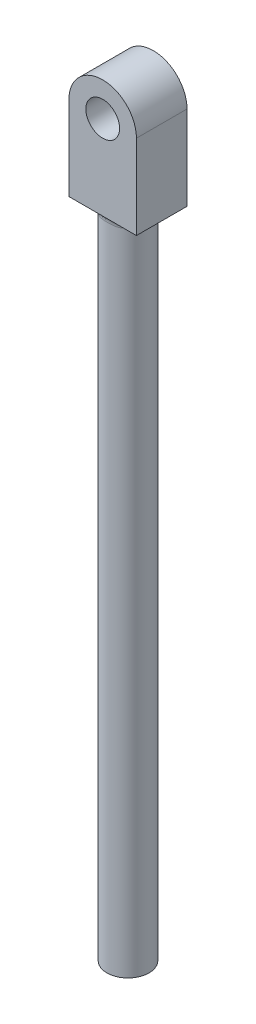
ISO-10303-21;
HEADER;
FILE_DESCRIPTION(('STEP AP214'),'2;1');
FILE_NAME('part.step','',(''),(''),'','','');
FILE_SCHEMA(('AUTOMOTIVE_DESIGN { 1 0 10303 214 1 1 1 1 }'));
ENDSEC;
DATA;
#1=APPLICATION_CONTEXT('core data for automotive mechanical design processes');
#2=APPLICATION_PROTOCOL_DEFINITION('international standard','automotive_design',2000,#1);
#3=PRODUCT_CONTEXT('',#1,'mechanical');
#4=PRODUCT('Part','Part','',(#3));
#5=PRODUCT_RELATED_PRODUCT_CATEGORY('part','',(#4));
#6=PRODUCT_DEFINITION_FORMATION('','',#4);
#7=PRODUCT_DEFINITION_CONTEXT('part definition',#1,'design');
#8=PRODUCT_DEFINITION('design','',#6,#7);
#9=PRODUCT_DEFINITION_SHAPE('','',#8);
#10=(LENGTH_UNIT() NAMED_UNIT(*) SI_UNIT(.MILLI.,.METRE.));
#11=(NAMED_UNIT(*) PLANE_ANGLE_UNIT() SI_UNIT($,.RADIAN.));
#12=(NAMED_UNIT(*) SI_UNIT($,.STERADIAN.) SOLID_ANGLE_UNIT());
#13=UNCERTAINTY_MEASURE_WITH_UNIT(LENGTH_MEASURE(1.E-05),#10,'distance_accuracy_value','');
#14=(GEOMETRIC_REPRESENTATION_CONTEXT(3) GLOBAL_UNCERTAINTY_ASSIGNED_CONTEXT((#13)) GLOBAL_UNIT_ASSIGNED_CONTEXT((#10,
#11,#12)) REPRESENTATION_CONTEXT('',''));
#15=CARTESIAN_POINT('',(0.,0.,0.));
#16=DIRECTION('',(0.,0.,1.));
#17=DIRECTION('',(1.,0.,0.));
#18=AXIS2_PLACEMENT_3D('',#15,#16,#17);
#19=CARTESIAN_POINT('',(4.,78.,3.));
#20=DIRECTION('',(0.,1.,0.));
#21=DIRECTION('',(0.,0.,1.));
#22=AXIS2_PLACEMENT_3D('',#19,#20,#21);
#23=PLANE('',#22);
#24=DIRECTION('',(1.,0.,0.));
#25=VECTOR('',#24,1.);
#26=CARTESIAN_POINT('',(4.,78.,3.));
#27=LINE('',#26,#25);
#28=CARTESIAN_POINT('',(1.802775637732,78.,3.));
#29=VERTEX_POINT('',#28);
#30=CARTESIAN_POINT('',(4.,78.,3.));
#31=VERTEX_POINT('',#30);
#32=EDGE_CURVE('E120',#29,#31,#27,.T.);
#33=ORIENTED_EDGE('',*,*,#32,.F.);
#34=CARTESIAN_POINT('',(0.,78.,0.));
#35=DIRECTION('',(0.,1.,0.));
#36=DIRECTION('',(0.,0.,1.));
#37=AXIS2_PLACEMENT_3D('',#34,#35,#36);
#38=CIRCLE('',#37,3.5);
#39=CARTESIAN_POINT('',(1.802775637732,78.,-3.));
#40=VERTEX_POINT('',#39);
#41=EDGE_CURVE('E139',#29,#40,#38,.T.);
#42=ORIENTED_EDGE('',*,*,#41,.T.);
#43=DIRECTION('',(1.,0.,0.));
#44=VECTOR('',#43,1.);
#45=CARTESIAN_POINT('',(4.,78.,-3.));
#46=LINE('',#45,#44);
#47=CARTESIAN_POINT('',(4.,78.,-3.));
#48=VERTEX_POINT('',#47);
#49=EDGE_CURVE('E244',#40,#48,#46,.T.);
#50=ORIENTED_EDGE('',*,*,#49,.T.);
#51=DIRECTION('',(0.,0.,-1.));
#52=VECTOR('',#51,1.);
#53=CARTESIAN_POINT('',(4.,78.,3.));
#54=LINE('',#53,#52);
#55=EDGE_CURVE('E231',#31,#48,#54,.T.);
#56=ORIENTED_EDGE('',*,*,#55,.F.);
#57=EDGE_LOOP('',(#33,#42,#50,#56));
#58=FACE_BOUND('',#57,.T.);
#59=ADVANCED_FACE('F35',(#58),#23,.F.);
#60=CARTESIAN_POINT('',(0.,78.,0.));
#61=DIRECTION('',(0.,-1.,0.));
#62=DIRECTION('',(0.,0.,-1.));
#63=AXIS2_PLACEMENT_3D('',#60,#61,#62);
#64=CYLINDRICAL_SURFACE('',#63,2.5);
#65=CARTESIAN_POINT('',(-2.35869567369908,78.,3.));
#66=CARTESIAN_POINT('',(-1.38765648288614,78.4013055840775,2.11805305184009));
#67=CARTESIAN_POINT('',(-1.68478262407077,77.089797118085,1.84702666727614));
#68=CARTESIAN_POINT('',(-2.32311558212303,78.,3.));
#69=CARTESIAN_POINT('',(-1.39485788528736,78.3701378909477,2.10409965880879));
#70=CARTESIAN_POINT('',(-1.65936827293123,77.0750365677151,1.87021882017817));
#71=CARTESIAN_POINT('',(-2.28639723116135,78.,3.));
#72=CARTESIAN_POINT('',(-1.39873123079868,78.3378304890209,2.09472768310197));
#73=CARTESIAN_POINT('',(-1.63314087938532,77.0624960551256,1.89317065476329));
#74=CARTESIAN_POINT('',(-2.21106569716947,78.,3.));
#75=CARTESIAN_POINT('',(-1.3997411936574,78.2739687568214,2.08398106756867));
#76=CARTESIAN_POINT('',(-1.57933264082474,77.0413121648804,1.93827997476053));
#77=CARTESIAN_POINT('',(-2.17245674140753,78.,3.));
#78=CARTESIAN_POINT('',(-1.39707606759514,78.2424003619311,2.08237228525282));
#79=CARTESIAN_POINT('',(-1.55175481528736,77.0326604969719,1.96043905638493));
#80=CARTESIAN_POINT('',(-2.0550374571556,78.,3.));
#81=CARTESIAN_POINT('',(-1.38007393620704,78.153160239198,2.08663625544711));
#82=CARTESIAN_POINT('',(-1.46788389797565,77.0118107698363,2.02490711609743));
#83=CARTESIAN_POINT('',(-1.97380140817705,78.,3.));
#84=CARTESIAN_POINT('',(-1.35734706621003,78.0973752365874,2.1005616847414));
#85=CARTESIAN_POINT('',(-1.40985814870031,77.00440526438,2.06575259890431));
#86=CARTESIAN_POINT('',(-1.75392729295753,78.,3.));
#87=CARTESIAN_POINT('',(-1.27354998841388,77.971793247003,2.15151066419809));
#88=CARTESIAN_POINT('',(-1.25280520925144,76.996699571837,2.16653078185198));
#89=CARTESIAN_POINT('',(-1.61136722148825,78.,3.));
#90=CARTESIAN_POINT('',(-1.19776380716159,77.9094620246063,2.19733566368003));
#91=CARTESIAN_POINT('',(-1.15097658677618,77.0038144970095,2.22227780908098));
#92=CARTESIAN_POINT('',(-1.3167656872778,78.,3.));
#93=CARTESIAN_POINT('',(-1.01589565420037,77.8178292510466,2.28776397044252));
#94=CARTESIAN_POINT('',(-0.940546919485291,77.0285142350657,2.31925618416502));
#95=CARTESIAN_POINT('',(-1.16466065319865,78.,3.));
#96=CARTESIAN_POINT('',(-0.909812051412294,77.7862845207067,2.33312424012958));
#97=CARTESIAN_POINT('',(-0.831900466571076,77.0461778500175,2.36037452380377));
#98=CARTESIAN_POINT('',(-0.926020418297913,78.,3.));
#99=CARTESIAN_POINT('',(-0.73293320756352,77.7528917245329,2.39215410620665));
#100=CARTESIAN_POINT('',(-0.661443155926754,77.0731582535501,2.41171212801427));
#101=CARTESIAN_POINT('',(-0.841741262734502,78.,3.));
#102=CARTESIAN_POINT('',(-0.669088597460062,77.7439634770233,2.41075944684106));
#103=CARTESIAN_POINT('',(-0.601243759095399,77.0825522109005,2.42742237789649));
#104=CARTESIAN_POINT('',(-0.671640114565505,78.,3.));
#105=CARTESIAN_POINT('',(-0.538014598545652,77.7300358645077,2.44303860810298));
#106=CARTESIAN_POINT('',(-0.479742938974958,77.0998403341181,2.45432605473145));
#107=CARTESIAN_POINT('',(-0.58581870211779,78.,3.));
#108=CARTESIAN_POINT('',(-0.470525326937831,77.7249453148161,2.45686188645871));
#109=CARTESIAN_POINT('',(-0.41844193008435,77.1077350515483,2.46552114449966));
#110=CARTESIAN_POINT('',(-0.413416044618902,78.,3.));
#111=CARTESIAN_POINT('',(-0.33373820501595,77.7174407917484,2.47886682684452));
#112=CARTESIAN_POINT('',(-0.295297174727572,77.1207588796569,2.483274322633));
#113=CARTESIAN_POINT('',(-0.326839860825596,78.,3.));
#114=CARTESIAN_POINT('',(-0.264142380679136,77.7149720886307,2.48717845577118));
#115=CARTESIAN_POINT('',(-0.2334570434456,77.1259001064712,2.48985276592176));
#116=CARTESIAN_POINT('',(-0.153105980955999,78.,3.));
#117=CARTESIAN_POINT('',(-0.12412820181531,77.7118654798941,2.49792896303268));
#118=CARTESIAN_POINT('',(-0.109361414969686,77.1326423774325,2.49838093998098));
#119=CARTESIAN_POINT('',(-0.0659483429589628,78.,3.));
#120=CARTESIAN_POINT('',(-0.0533690862010616,77.7112114325808,2.5004215525342));
#121=CARTESIAN_POINT('',(-0.0471059592609247,77.134243770003,2.50033112630897));
#122=CARTESIAN_POINT('',(0.113294954809667,78.,3.));
#123=CARTESIAN_POINT('',(0.0917267287856055,77.7114774751147,2.4994348313836));
#124=CARTESIAN_POINT('',(0.0809249677259711,77.1336139067538,2.49955575223617));
#125=CARTESIAN_POINT('',(0.205377910178801,78.,3.));
#126=CARTESIAN_POINT('',(0.166438542504271,77.7124911460776,2.49560052172953));
#127=CARTESIAN_POINT('',(0.146698507288994,77.1311586456095,2.49655692159848));
#128=CARTESIAN_POINT('',(0.38874137197067,78.,3.));
#129=CARTESIAN_POINT('',(0.313859143066368,77.716666788324,2.48158959625076));
#130=CARTESIAN_POINT('',(0.277672408532053,77.1224512074842,2.48540146107994));
#131=CARTESIAN_POINT('',(0.480021711384077,78.,3.));
#132=CARTESIAN_POINT('',(0.386964129925051,77.7198536950069,2.47133469855241));
#133=CARTESIAN_POINT('',(0.342872650919698,77.1161982583954,2.47724378233977));
#134=CARTESIAN_POINT('',(0.752849472792615,78.,3.));
#135=CARTESIAN_POINT('',(0.603266803000621,77.7342534174092,2.43139912857672));
#136=CARTESIAN_POINT('',(0.537749623298451,77.0932464010228,2.44504355931937));
#137=CARTESIAN_POINT('',(0.93231078737566,78.,3.));
#138=CARTESIAN_POINT('',(0.742186068976856,77.7505706277765,2.39210640783799));
#139=CARTESIAN_POINT('',(0.665936276663918,77.0723789849322,2.41327985383662));
#140=CARTESIAN_POINT('',(1.28529107997789,78.,3.));
#141=CARTESIAN_POINT('',(0.995192101211729,77.8098708915164,2.29892237927615));
#142=CARTESIAN_POINT('',(0.918065057160598,77.0325989277867,2.32918194316111));
#143=CARTESIAN_POINT('',(1.45866147138316,78.,3.));
#144=CARTESIAN_POINT('',(1.11025639067915,77.8552965844583,2.24305314597985));
#145=CARTESIAN_POINT('',(1.04190105099417,77.01372459553,2.27651421506211));
#146=CARTESIAN_POINT('',(1.70788624463759,78.,3.));
#147=CARTESIAN_POINT('',(1.24485988487906,77.9527001394436,2.16884641960795));
#148=CARTESIAN_POINT('',(1.21991874616664,77.0006561131893,2.1831694851541));
#149=CARTESIAN_POINT('',(1.78876815379288,78.,3.));
#150=CARTESIAN_POINT('',(1.28423049414722,77.9914812930602,2.14508379161502));
#151=CARTESIAN_POINT('',(1.27769153842252,76.9988115884042,2.14987102325304));
#152=CARTESIAN_POINT('',(1.94636259163608,78.,3.));
#153=CARTESIAN_POINT('',(1.34781643223733,78.0802128203742,2.10631330259423));
#154=CARTESIAN_POINT('',(1.39025899402643,77.0027809524236,2.07884509209173));
#155=CARTESIAN_POINT('',(2.02308180308889,78.,3.));
#156=CARTESIAN_POINT('',(1.37150981875894,78.1308276829838,2.09160274518387));
#157=CARTESIAN_POINT('',(1.44505843077795,77.0085821638041,2.04112504867191));
#158=CARTESIAN_POINT('',(2.15635225712963,78.,3.));
#159=CARTESIAN_POINT('',(1.39659640419795,78.2293462180589,2.081200774338));
#160=CARTESIAN_POINT('',(1.54025161223532,77.0287135788626,1.96987321995239));
#161=CARTESIAN_POINT('',(2.21387242172111,78.,3.));
#162=CARTESIAN_POINT('',(1.4010425557338,78.2764809877482,2.0827743075235));
#163=CARTESIAN_POINT('',(1.58133744408644,77.0411101719168,1.93700833370558));
#164=CARTESIAN_POINT('',(2.32505907666024,78.,3.));
#165=CARTESIAN_POINT('',(1.39609191158889,78.3718312861368,2.10297416756326));
#166=CARTESIAN_POINT('',(1.66075648332881,77.0748140684746,1.8694110652461));
#167=CARTESIAN_POINT('',(2.37867507618734,78.,3.));
#168=CARTESIAN_POINT('',(1.3859181178226,78.4200246778576,2.12254536468002));
#169=CARTESIAN_POINT('',(1.69905362584824,77.0962198088155,1.83466186451652));
#170=CARTESIAN_POINT('',(2.42947636202711,78.,3.));
#171=CARTESIAN_POINT('',(1.36823825990709,78.4637953692632,2.15360119143177));
#172=CARTESIAN_POINT('',(1.73534025859079,77.123030897226,1.79960945399663));
#173=(BOUNDED_SURFACE() B_SPLINE_SURFACE(3,2,((#65,#66,#67),(#68,#69,#70),(#71,#72,#73),(#74,
#75,#76),(#77,#78,#79),(#80,#81,#82),(#83,#84,#85),(#86,#87,#88),(#89,#90,#91),(#92,#93,#94),
(#95,#96,#97),(#98,#99,#100),(#101,#102,#103),(#104,#105,#106),(#107,#108,#109),(#110,#111,
#112),(#113,#114,#115),(#116,#117,#118),(#119,#120,#121),(#122,#123,#124),(#125,#126,#127),
(#128,#129,#130),(#131,#132,#133),(#134,#135,#136),(#137,#138,#139),(#140,#141,#142),(#143,#144,
#145),(#146,#147,#148),(#149,#150,#151),(#152,#153,#154),(#155,#156,#157),(#158,#159,#160),
(#161,#162,#163),(#164,#165,#166),(#167,#168,#169),(#170,#171,#172)),.UNSPECIFIED.,.F.,.F.,
.F.) B_SPLINE_SURFACE_WITH_KNOTS((4,2,2,2,2,2,2,2,2,2,2,2,2,2,2,2,2,4),(3,3),(0.,
0.150978452111826,0.30163350336517,0.599468504271139,1.08493079559649,1.57406582227356,
1.83667758241666,2.09919254100663,2.36054266600813,2.62186706535206,2.89810917700121,
3.17440747024336,3.73017973784784,4.29520076320599,4.57485505395888,4.8540462317444,
5.07750820983555,5.30347792971447),(0.,1.),
.UNSPECIFIED.) GEOMETRIC_REPRESENTATION_ITEM() RATIONAL_B_SPLINE_SURFACE(((1.,0.589072238635037,
1.),(1.,0.597621981679865,1.),(1.,0.606281072137647,1.),(1.,0.623622640940445,1.),(1.,
0.632305029457272,1.),(1.,0.65795279537019,1.),(1.,0.674723639585419,1.),(1.,0.716899899837873,
1.),(1.,0.741089115601704,1.),(1.,0.783806931119411,1.),(1.,0.802291321337421,1.),(1.,
0.82554834066481,1.),(1.,0.832706660558889,1.),(1.,0.845003938290564,1.),(1.,0.850143639514364,
1.),(1.,0.85830796330375,1.),(1.,0.861341869719552,1.),(1.,0.865276991795516,1.),(1.,
0.866178417354905,1.),(1.,0.86582013765781,1.),(1.,0.864434126698029,1.),(1.,0.859289909346193,
1.),(1.,0.855531220558891,1.),(1.,0.840741031559042,1.),(1.,0.826198716210341,1.),(1.,
0.788270185201544,1.),(1.,0.764740823018149,1.),(1.,0.724264523444234,1.),(1.,0.709994983454149,
1.),(1.,0.680153160391996,1.),(1.,0.664583073820711,1.),(1.,0.635979859402385,1.),(1.,
0.623060704128218,1.),(1.,0.597254296383184,1.),(1.,0.58436902895136,1.),(1.,0.571874723989404,1.))) REPRESENTATION_ITEM('') SURFACE());
#174=CARTESIAN_POINT('',(1.73534025859079,77.123030897226,1.79960945399663));
#175=CARTESIAN_POINT('',(1.69905362584824,77.0962198088155,1.83466186451652));
#176=CARTESIAN_POINT('',(1.66075648332881,77.0748140684746,1.8694110652461));
#177=CARTESIAN_POINT('',(1.58133744408644,77.0411101719168,1.93700833370558));
#178=CARTESIAN_POINT('',(1.54025161223532,77.0287135788626,1.96987321995239));
#179=CARTESIAN_POINT('',(1.44505843077795,77.0085821638041,2.04112504867191));
#180=CARTESIAN_POINT('',(1.39025899402643,77.0027809524236,2.07884509209173));
#181=CARTESIAN_POINT('',(1.27769153842252,76.9988115884042,2.14987102325304));
#182=CARTESIAN_POINT('',(1.21991874616664,77.0006561131893,2.1831694851541));
#183=CARTESIAN_POINT('',(1.04190105099417,77.01372459553,2.27651421506211));
#184=CARTESIAN_POINT('',(0.918065057160598,77.0325989277867,2.32918194316111));
#185=CARTESIAN_POINT('',(0.665936276663918,77.0723789849322,2.41327985383662));
#186=CARTESIAN_POINT('',(0.537749623298451,77.0932464010228,2.44504355931937));
#187=CARTESIAN_POINT('',(0.342872650919698,77.1161982583954,2.47724378233977));
#188=CARTESIAN_POINT('',(0.277672408532053,77.1224512074842,2.48540146107994));
#189=CARTESIAN_POINT('',(0.146698507288994,77.1311586456095,2.49655692159848));
#190=CARTESIAN_POINT('',(0.0809249677259711,77.1336139067538,2.49955575223617));
#191=CARTESIAN_POINT('',(-0.0471059592609247,77.134243770003,2.50033112630897));
#192=CARTESIAN_POINT('',(-0.109361414969686,77.1326423774325,2.49838093998098));
#193=CARTESIAN_POINT('',(-0.2334570434456,77.1259001064712,2.48985276592176));
#194=CARTESIAN_POINT('',(-0.295297174727572,77.1207588796569,2.483274322633));
#195=CARTESIAN_POINT('',(-0.41844193008435,77.1077350515484,2.46552114449966));
#196=CARTESIAN_POINT('',(-0.479742938974958,77.0998403341181,2.45432605473145));
#197=CARTESIAN_POINT('',(-0.601243759095399,77.0825522109005,2.42742237789649));
#198=CARTESIAN_POINT('',(-0.661443155926754,77.0731582535501,2.41171212801427));
#199=CARTESIAN_POINT('',(-0.831900466571076,77.0461778500175,2.36037452380377));
#200=CARTESIAN_POINT('',(-0.940546919485291,77.0285142350657,2.31925618416502));
#201=CARTESIAN_POINT('',(-1.15097658677618,77.0038144970095,2.22227780908098));
#202=CARTESIAN_POINT('',(-1.25280520925144,76.996699571837,2.16653078185198));
#203=CARTESIAN_POINT('',(-1.40985814870031,77.00440526438,2.06575259890431));
#204=CARTESIAN_POINT('',(-1.46788389797565,77.0118107698363,2.02490711609743));
#205=CARTESIAN_POINT('',(-1.55175481528736,77.0326604969719,1.96043905638493));
#206=CARTESIAN_POINT('',(-1.57933264082474,77.0413121648804,1.93827997476053));
#207=CARTESIAN_POINT('',(-1.63314087938532,77.0624960551256,1.89317065476329));
#208=CARTESIAN_POINT('',(-1.65936827293123,77.0750365677151,1.87021882017817));
#209=CARTESIAN_POINT('',(-1.68478262407077,77.089797118085,1.84702666727614));
#210=B_SPLINE_CURVE_WITH_KNOTS('',3,(#174,#175,#176,#177,#178,#179,#180,#181,#182,#183,#184,
#185,#186,#187,#188,#189,#190,#191,#192,#193,#194,#195,#196,#197,#198,#199,#200,#201,#202,#203,
#204,#205,#206,#207,#208,#209),.UNSPECIFIED.,.F.,.F.,(4,2,2,2,2,2,2,2,2,2,2,2,2,2,2,2,2,4),(0.,
0.225969719878918,0.449431697970066,0.728622875755586,1.00827716650848,1.57329819186662,
2.1290704594711,2.40536875271325,2.68161086436241,2.94293526370634,3.20428538870783,
3.4668003472978,3.72941210744091,4.21854713411797,4.70400942544333,5.00184442634929,
5.15249947760264,5.30347792971447),.UNSPECIFIED.);
#211=CARTESIAN_POINT('',(1.28769688409428,77.,2.14285714285714));
#212=VERTEX_POINT('',#211);
#213=CARTESIAN_POINT('',(-1.28769688409428,77.,2.14285714285714));
#214=VERTEX_POINT('',#213);
#215=EDGE_CURVE('E141',#212,#214,#210,.T.);
#216=ORIENTED_EDGE('',*,*,#215,.T.);
#217=CARTESIAN_POINT('',(0.,77.,0.));
#218=DIRECTION('',(0.,1.,0.));
#219=DIRECTION('',(0.,0.,1.));
#220=AXIS2_PLACEMENT_3D('',#217,#218,#219);
#221=CIRCLE('',#220,2.5);
#222=CARTESIAN_POINT('',(-1.28769688409428,77.,-2.14285714285714));
#223=VERTEX_POINT('',#222);
#224=EDGE_CURVE('E11',#214,#223,#221,.F.);
#225=ORIENTED_EDGE('',*,*,#224,.T.);
#226=CARTESIAN_POINT('',(2.35869567369908,78.,-3.));
#227=CARTESIAN_POINT('',(1.38765648288614,78.4013055840775,-2.11805305184009));
#228=CARTESIAN_POINT('',(1.68478262407077,77.089797118085,-1.84702666727614));
#229=CARTESIAN_POINT('',(2.32311558212303,78.,-3.));
#230=CARTESIAN_POINT('',(1.39485788528736,78.3701378909477,-2.10409965880879));
#231=CARTESIAN_POINT('',(1.65936827293123,77.0750365677151,-1.87021882017817));
#232=CARTESIAN_POINT('',(2.28639723116135,78.,-3.));
#233=CARTESIAN_POINT('',(1.39873123079868,78.3378304890209,-2.09472768310197));
#234=CARTESIAN_POINT('',(1.63314087938532,77.0624960551256,-1.89317065476329));
#235=CARTESIAN_POINT('',(2.21106569716947,78.,-3.));
#236=CARTESIAN_POINT('',(1.3997411936574,78.2739687568215,-2.08398106756867));
#237=CARTESIAN_POINT('',(1.57933264082474,77.0413121648804,-1.93827997476053));
#238=CARTESIAN_POINT('',(2.17245674140753,78.,-3.));
#239=CARTESIAN_POINT('',(1.39707606759514,78.2424003619311,-2.08237228525282));
#240=CARTESIAN_POINT('',(1.55175481528736,77.0326604969719,-1.96043905638493));
#241=CARTESIAN_POINT('',(2.0550374571556,78.,-3.));
#242=CARTESIAN_POINT('',(1.38007393620704,78.153160239198,-2.08663625544711));
#243=CARTESIAN_POINT('',(1.46788389797565,77.0118107698363,-2.02490711609743));
#244=CARTESIAN_POINT('',(1.97380140817705,78.,-3.));
#245=CARTESIAN_POINT('',(1.35734706621003,78.0973752365874,-2.1005616847414));
#246=CARTESIAN_POINT('',(1.40985814870031,77.00440526438,-2.06575259890431));
#247=CARTESIAN_POINT('',(1.75392729295753,78.,-3.));
#248=CARTESIAN_POINT('',(1.27354998841388,77.971793247003,-2.15151066419809));
#249=CARTESIAN_POINT('',(1.25280520925144,76.996699571837,-2.16653078185198));
#250=CARTESIAN_POINT('',(1.61136722148825,78.,-3.));
#251=CARTESIAN_POINT('',(1.19776380716159,77.9094620246063,-2.19733566368003));
#252=CARTESIAN_POINT('',(1.15097658677618,77.0038144970095,-2.22227780908098));
#253=CARTESIAN_POINT('',(1.3167656872778,78.,-3.));
#254=CARTESIAN_POINT('',(1.01589565420037,77.8178292510466,-2.28776397044252));
#255=CARTESIAN_POINT('',(0.940546919485291,77.0285142350657,-2.31925618416502));
#256=CARTESIAN_POINT('',(1.16466065319865,78.,-3.));
#257=CARTESIAN_POINT('',(0.909812051412293,77.7862845207067,-2.33312424012958));
#258=CARTESIAN_POINT('',(0.831900466571076,77.0461778500175,-2.36037452380377));
#259=CARTESIAN_POINT('',(0.926020418297912,78.,-3.));
#260=CARTESIAN_POINT('',(0.73293320756352,77.7528917245329,-2.39215410620665));
#261=CARTESIAN_POINT('',(0.661443155926754,77.0731582535501,-2.41171212801427));
#262=CARTESIAN_POINT('',(0.841741262734502,78.,-3.));
#263=CARTESIAN_POINT('',(0.669088597460062,77.7439634770233,-2.41075944684106));
#264=CARTESIAN_POINT('',(0.601243759095399,77.0825522109005,-2.42742237789649));
#265=CARTESIAN_POINT('',(0.671640114565505,78.,-3.));
#266=CARTESIAN_POINT('',(0.538014598545652,77.7300358645077,-2.44303860810298));
#267=CARTESIAN_POINT('',(0.479742938974958,77.0998403341181,-2.45432605473145));
#268=CARTESIAN_POINT('',(0.585818702117789,78.,-3.));
#269=CARTESIAN_POINT('',(0.470525326937831,77.7249453148161,-2.45686188645871));
#270=CARTESIAN_POINT('',(0.41844193008435,77.1077350515483,-2.46552114449966));
#271=CARTESIAN_POINT('',(0.413416044618901,78.,-3.));
#272=CARTESIAN_POINT('',(0.33373820501595,77.7174407917484,-2.47886682684452));
#273=CARTESIAN_POINT('',(0.295297174727572,77.1207588796569,-2.483274322633));
#274=CARTESIAN_POINT('',(0.326839860825596,78.,-3.));
#275=CARTESIAN_POINT('',(0.264142380679136,77.7149720886307,-2.48717845577118));
#276=CARTESIAN_POINT('',(0.2334570434456,77.1259001064712,-2.48985276592176));
#277=CARTESIAN_POINT('',(0.153105980956,78.,-3.));
#278=CARTESIAN_POINT('',(0.12412820181531,77.7118654798941,-2.49792896303268));
#279=CARTESIAN_POINT('',(0.109361414969686,77.1326423774325,-2.49838093998098));
#280=CARTESIAN_POINT('',(0.065948342958963,78.,-3.));
#281=CARTESIAN_POINT('',(0.0533690862010617,77.7112114325808,-2.5004215525342));
#282=CARTESIAN_POINT('',(0.0471059592609247,77.134243770003,-2.50033112630897));
#283=CARTESIAN_POINT('',(-0.113294954809667,78.,-3.));
#284=CARTESIAN_POINT('',(-0.0917267287856056,77.7114774751147,-2.4994348313836));
#285=CARTESIAN_POINT('',(-0.0809249677259711,77.1336139067538,-2.49955575223617));
#286=CARTESIAN_POINT('',(-0.205377910178801,78.,-3.));
#287=CARTESIAN_POINT('',(-0.166438542504271,77.7124911460776,-2.49560052172953));
#288=CARTESIAN_POINT('',(-0.146698507288994,77.1311586456095,-2.49655692159848));
#289=CARTESIAN_POINT('',(-0.388741371970671,78.,-3.));
#290=CARTESIAN_POINT('',(-0.313859143066368,77.716666788324,-2.48158959625076));
#291=CARTESIAN_POINT('',(-0.277672408532053,77.1224512074842,-2.48540146107994));
#292=CARTESIAN_POINT('',(-0.480021711384077,78.,-3.));
#293=CARTESIAN_POINT('',(-0.386964129925051,77.7198536950069,-2.47133469855241));
#294=CARTESIAN_POINT('',(-0.342872650919698,77.1161982583954,-2.47724378233977));
#295=CARTESIAN_POINT('',(-0.752849472792615,78.,-3.));
#296=CARTESIAN_POINT('',(-0.603266803000621,77.7342534174092,-2.43139912857672));
#297=CARTESIAN_POINT('',(-0.537749623298451,77.0932464010228,-2.44504355931937));
#298=CARTESIAN_POINT('',(-0.93231078737566,78.,-3.));
#299=CARTESIAN_POINT('',(-0.742186068976856,77.7505706277765,-2.39210640783799));
#300=CARTESIAN_POINT('',(-0.665936276663918,77.0723789849322,-2.41327985383662));
#301=CARTESIAN_POINT('',(-1.28529107997789,78.,-3.));
#302=CARTESIAN_POINT('',(-0.99519210121173,77.8098708915164,-2.29892237927615));
#303=CARTESIAN_POINT('',(-0.918065057160598,77.0325989277867,-2.32918194316111));
#304=CARTESIAN_POINT('',(-1.45866147138316,78.,-3.));
#305=CARTESIAN_POINT('',(-1.11025639067915,77.8552965844583,-2.24305314597985));
#306=CARTESIAN_POINT('',(-1.04190105099417,77.01372459553,-2.27651421506211));
#307=CARTESIAN_POINT('',(-1.70788624463759,78.,-3.));
#308=CARTESIAN_POINT('',(-1.24485988487906,77.9527001394436,-2.16884641960795));
#309=CARTESIAN_POINT('',(-1.21991874616664,77.0006561131893,-2.1831694851541));
#310=CARTESIAN_POINT('',(-1.78876815379288,78.,-3.));
#311=CARTESIAN_POINT('',(-1.28423049414722,77.9914812930602,-2.14508379161502));
#312=CARTESIAN_POINT('',(-1.27769153842252,76.9988115884042,-2.14987102325304));
#313=CARTESIAN_POINT('',(-1.94636259163608,78.,-3.));
#314=CARTESIAN_POINT('',(-1.34781643223733,78.0802128203742,-2.10631330259423));
#315=CARTESIAN_POINT('',(-1.39025899402643,77.0027809524236,-2.07884509209173));
#316=CARTESIAN_POINT('',(-2.02308180308889,78.,-3.));
#317=CARTESIAN_POINT('',(-1.37150981875894,78.1308276829838,-2.09160274518387));
#318=CARTESIAN_POINT('',(-1.44505843077795,77.0085821638041,-2.04112504867191));
#319=CARTESIAN_POINT('',(-2.15635225712963,78.,-3.));
#320=CARTESIAN_POINT('',(-1.39659640419795,78.2293462180589,-2.081200774338));
#321=CARTESIAN_POINT('',(-1.54025161223532,77.0287135788626,-1.96987321995239));
#322=CARTESIAN_POINT('',(-2.21387242172111,78.,-3.));
#323=CARTESIAN_POINT('',(-1.4010425557338,78.2764809877482,-2.0827743075235));
#324=CARTESIAN_POINT('',(-1.58133744408644,77.0411101719168,-1.93700833370558));
#325=CARTESIAN_POINT('',(-2.32505907666024,78.,-3.));
#326=CARTESIAN_POINT('',(-1.39609191158889,78.3718312861368,-2.10297416756326));
#327=CARTESIAN_POINT('',(-1.66075648332881,77.0748140684746,-1.8694110652461));
#328=CARTESIAN_POINT('',(-2.37867507618734,78.,-3.));
#329=CARTESIAN_POINT('',(-1.3859181178226,78.4200246778576,-2.12254536468002));
#330=CARTESIAN_POINT('',(-1.69905362584824,77.0962198088155,-1.83466186451652));
#331=CARTESIAN_POINT('',(-2.42947636202711,78.,-3.));
#332=CARTESIAN_POINT('',(-1.36823825990709,78.4637953692632,-2.15360119143177));
#333=CARTESIAN_POINT('',(-1.73534025859079,77.123030897226,-1.79960945399663));
#334=(BOUNDED_SURFACE() B_SPLINE_SURFACE(3,2,((#226,#227,#228),(#229,#230,#231),(#232,#233,
#234),(#235,#236,#237),(#238,#239,#240),(#241,#242,#243),(#244,#245,#246),(#247,#248,#249),
(#250,#251,#252),(#253,#254,#255),(#256,#257,#258),(#259,#260,#261),(#262,#263,#264),(#265,#266,
#267),(#268,#269,#270),(#271,#272,#273),(#274,#275,#276),(#277,#278,#279),(#280,#281,#282),
(#283,#284,#285),(#286,#287,#288),(#289,#290,#291),(#292,#293,#294),(#295,#296,#297),(#298,#299,
#300),(#301,#302,#303),(#304,#305,#306),(#307,#308,#309),(#310,#311,#312),(#313,#314,#315),
(#316,#317,#318),(#319,#320,#321),(#322,#323,#324),(#325,#326,#327),(#328,#329,#330),(#331,#332,
#333)),.UNSPECIFIED.,.F.,.F.,.F.) B_SPLINE_SURFACE_WITH_KNOTS((4,2,2,2,2,2,2,2,2,2,2,2,2,2,2,2,
2,4),(3,3),(0.,0.150978452111826,0.30163350336517,0.599468504271139,1.08493079559649,
1.57406582227356,1.83667758241666,2.09919254100663,2.36054266600813,2.62186706535206,
2.89810917700121,3.17440747024336,3.73017973784784,4.29520076320599,4.57485505395888,
4.8540462317444,5.07750820983555,5.30347792971447),(0.,1.),
.UNSPECIFIED.) GEOMETRIC_REPRESENTATION_ITEM() RATIONAL_B_SPLINE_SURFACE(((1.,0.589072238635037,
1.),(1.,0.597621981679865,1.),(1.,0.606281072137647,1.),(1.,0.623622640940445,1.),(1.,
0.632305029457272,1.),(1.,0.65795279537019,1.),(1.,0.674723639585419,1.),(1.,0.716899899837873,
1.),(1.,0.741089115601704,1.),(1.,0.783806931119412,1.),(1.,0.802291321337421,1.),(1.,
0.82554834066481,1.),(1.,0.832706660558889,1.),(1.,0.845003938290564,1.),(1.,0.850143639514364,
1.),(1.,0.85830796330375,1.),(1.,0.861341869719552,1.),(1.,0.865276991795516,1.),(1.,
0.866178417354905,1.),(1.,0.86582013765781,1.),(1.,0.864434126698029,1.),(1.,0.859289909346193,
1.),(1.,0.855531220558891,1.),(1.,0.840741031559042,1.),(1.,0.826198716210341,1.),(1.,
0.788270185201544,1.),(1.,0.764740823018149,1.),(1.,0.724264523444234,1.),(1.,0.709994983454149,
1.),(1.,0.680153160391996,1.),(1.,0.664583073820711,1.),(1.,0.635979859402385,1.),(1.,
0.623060704128218,1.),(1.,0.597254296383184,1.),(1.,0.58436902895136,1.),(1.,0.571874723989404,1.))) REPRESENTATION_ITEM('') SURFACE());
#335=CARTESIAN_POINT('',(-1.73534025859079,77.123030897226,-1.79960945399663));
#336=CARTESIAN_POINT('',(-1.69905362584824,77.0962198088155,-1.83466186451652));
#337=CARTESIAN_POINT('',(-1.66075648332881,77.0748140684746,-1.8694110652461));
#338=CARTESIAN_POINT('',(-1.58133744408644,77.0411101719168,-1.93700833370558));
#339=CARTESIAN_POINT('',(-1.54025161223532,77.0287135788626,-1.96987321995239));
#340=CARTESIAN_POINT('',(-1.44505843077795,77.0085821638041,-2.04112504867191));
#341=CARTESIAN_POINT('',(-1.39025899402643,77.0027809524236,-2.07884509209173));
#342=CARTESIAN_POINT('',(-1.27769153842252,76.9988115884042,-2.14987102325304));
#343=CARTESIAN_POINT('',(-1.21991874616664,77.0006561131893,-2.1831694851541));
#344=CARTESIAN_POINT('',(-1.04190105099417,77.01372459553,-2.27651421506211));
#345=CARTESIAN_POINT('',(-0.918065057160598,77.0325989277867,-2.32918194316111));
#346=CARTESIAN_POINT('',(-0.665936276663918,77.0723789849322,-2.41327985383662));
#347=CARTESIAN_POINT('',(-0.537749623298451,77.0932464010228,-2.44504355931937));
#348=CARTESIAN_POINT('',(-0.342872650919698,77.1161982583954,-2.47724378233977));
#349=CARTESIAN_POINT('',(-0.277672408532053,77.1224512074842,-2.48540146107994));
#350=CARTESIAN_POINT('',(-0.146698507288994,77.1311586456095,-2.49655692159848));
#351=CARTESIAN_POINT('',(-0.0809249677259711,77.1336139067538,-2.49955575223617));
#352=CARTESIAN_POINT('',(0.0471059592609247,77.134243770003,-2.50033112630897));
#353=CARTESIAN_POINT('',(0.109361414969686,77.1326423774325,-2.49838093998098));
#354=CARTESIAN_POINT('',(0.2334570434456,77.1259001064712,-2.48985276592176));
#355=CARTESIAN_POINT('',(0.295297174727572,77.1207588796569,-2.483274322633));
#356=CARTESIAN_POINT('',(0.41844193008435,77.1077350515484,-2.46552114449966));
#357=CARTESIAN_POINT('',(0.479742938974958,77.0998403341181,-2.45432605473145));
#358=CARTESIAN_POINT('',(0.601243759095399,77.0825522109005,-2.42742237789649));
#359=CARTESIAN_POINT('',(0.661443155926754,77.0731582535501,-2.41171212801427));
#360=CARTESIAN_POINT('',(0.831900466571076,77.0461778500175,-2.36037452380377));
#361=CARTESIAN_POINT('',(0.940546919485291,77.0285142350657,-2.31925618416502));
#362=CARTESIAN_POINT('',(1.15097658677618,77.0038144970095,-2.22227780908098));
#363=CARTESIAN_POINT('',(1.25280520925144,76.996699571837,-2.16653078185198));
#364=CARTESIAN_POINT('',(1.40985814870031,77.00440526438,-2.06575259890431));
#365=CARTESIAN_POINT('',(1.46788389797565,77.0118107698363,-2.02490711609743));
#366=CARTESIAN_POINT('',(1.55175481528736,77.0326604969719,-1.96043905638493));
#367=CARTESIAN_POINT('',(1.57933264082474,77.0413121648804,-1.93827997476053));
#368=CARTESIAN_POINT('',(1.63314087938532,77.0624960551256,-1.89317065476329));
#369=CARTESIAN_POINT('',(1.65936827293123,77.0750365677151,-1.87021882017817));
#370=CARTESIAN_POINT('',(1.68478262407077,77.089797118085,-1.84702666727614));
#371=B_SPLINE_CURVE_WITH_KNOTS('',3,(#335,#336,#337,#338,#339,#340,#341,#342,#343,#344,#345,
#346,#347,#348,#349,#350,#351,#352,#353,#354,#355,#356,#357,#358,#359,#360,#361,#362,#363,#364,
#365,#366,#367,#368,#369,#370),.UNSPECIFIED.,.F.,.F.,(4,2,2,2,2,2,2,2,2,2,2,2,2,2,2,2,2,4),(0.,
0.225969719878918,0.449431697970066,0.728622875755586,1.00827716650848,1.57329819186662,
2.1290704594711,2.40536875271325,2.68161086436241,2.94293526370634,3.20428538870783,
3.4668003472978,3.72941210744091,4.21854713411797,4.70400942544333,5.00184442634929,
5.15249947760264,5.30347792971447),.UNSPECIFIED.);
#372=CARTESIAN_POINT('',(1.28769688409428,77.,-2.14285714285714));
#373=VERTEX_POINT('',#372);
#374=EDGE_CURVE('E48',#223,#373,#371,.T.);
#375=ORIENTED_EDGE('',*,*,#374,.T.);
#376=CARTESIAN_POINT('',(0.,77.,0.));
#377=DIRECTION('',(0.,1.,0.));
#378=DIRECTION('',(0.,0.,1.));
#379=AXIS2_PLACEMENT_3D('',#376,#377,#378);
#380=CIRCLE('',#379,2.5);
#381=EDGE_CURVE('E149',#373,#212,#380,.F.);
#382=ORIENTED_EDGE('',*,*,#381,.T.);
#383=EDGE_LOOP('',(#216,#225,#375,#382));
#384=FACE_BOUND('',#383,.T.);
#385=CARTESIAN_POINT('',(0.,0.,0.));
#386=DIRECTION('',(0.,1.,0.));
#387=DIRECTION('',(0.,0.,1.));
#388=AXIS2_PLACEMENT_3D('',#385,#386,#387);
#389=CIRCLE('',#388,2.5);
#390=CARTESIAN_POINT('',(0.,0.,2.5));
#391=VERTEX_POINT('',#390);
#392=EDGE_CURVE('E129',#391,#391,#389,.T.);
#393=ORIENTED_EDGE('',*,*,#392,.T.);
#394=EDGE_LOOP('',(#393));
#395=FACE_BOUND('',#394,.T.);
#396=ADVANCED_FACE('F151',(#384,#395),#64,.T.);
#397=CARTESIAN_POINT('',(0.,0.,0.));
#398=DIRECTION('',(0.,1.,0.));
#399=DIRECTION('',(0.,0.,1.));
#400=AXIS2_PLACEMENT_3D('',#397,#398,#399);
#401=PLANE('',#400);
#402=ORIENTED_EDGE('',*,*,#392,.F.);
#403=EDGE_LOOP('',(#402));
#404=FACE_BOUND('',#403,.T.);
#405=ADVANCED_FACE('F268',(#404),#401,.F.);
#406=CARTESIAN_POINT('',(0.,88.,3.));
#407=DIRECTION('',(0.,0.,1.));
#408=DIRECTION('',(1.,0.,0.));
#409=AXIS2_PLACEMENT_3D('',#406,#407,#408);
#410=PLANE('',#409);
#411=DIRECTION('',(0.,1.,0.));
#412=VECTOR('',#411,1.);
#413=CARTESIAN_POINT('',(4.,78.,3.));
#414=LINE('',#413,#412);
#415=CARTESIAN_POINT('',(4.,88.,3.));
#416=VERTEX_POINT('',#415);
#417=EDGE_CURVE('E113',#31,#416,#414,.T.);
#418=ORIENTED_EDGE('',*,*,#417,.T.);
#419=CARTESIAN_POINT('',(0.,88.,3.));
#420=DIRECTION('',(0.,0.,1.));
#421=DIRECTION('',(1.,0.,0.));
#422=AXIS2_PLACEMENT_3D('',#419,#420,#421);
#423=CIRCLE('',#422,4.);
#424=CARTESIAN_POINT('',(-4.,88.,3.));
#425=VERTEX_POINT('',#424);
#426=EDGE_CURVE('E102',#416,#425,#423,.T.);
#427=ORIENTED_EDGE('',*,*,#426,.T.);
#428=DIRECTION('',(0.,-1.,0.));
#429=VECTOR('',#428,1.);
#430=CARTESIAN_POINT('',(-4.,78.,3.));
#431=LINE('',#430,#429);
#432=CARTESIAN_POINT('',(-4.,78.,3.));
#433=VERTEX_POINT('',#432);
#434=EDGE_CURVE('E112',#425,#433,#431,.T.);
#435=ORIENTED_EDGE('',*,*,#434,.T.);
#436=CARTESIAN_POINT('',(-1.802775637732,78.,3.));
#437=VERTEX_POINT('',#436);
#438=EDGE_CURVE('E234',#433,#437,#27,.T.);
#439=ORIENTED_EDGE('',*,*,#438,.T.);
#440=EDGE_CURVE('E232',#437,#29,#27,.T.);
#441=ORIENTED_EDGE('',*,*,#440,.T.);
#442=ORIENTED_EDGE('',*,*,#32,.T.);
#443=EDGE_LOOP('',(#418,#427,#435,#439,#441,#442));
#444=FACE_BOUND('',#443,.T.);
#445=CARTESIAN_POINT('',(0.,88.,3.));
#446=DIRECTION('',(0.,0.,1.));
#447=DIRECTION('',(1.,0.,0.));
#448=AXIS2_PLACEMENT_3D('',#445,#446,#447);
#449=CIRCLE('',#448,2.);
#450=CARTESIAN_POINT('',(2.,88.,3.));
#451=VERTEX_POINT('',#450);
#452=EDGE_CURVE('E212',#451,#451,#449,.T.);
#453=ORIENTED_EDGE('',*,*,#452,.F.);
#454=EDGE_LOOP('',(#453));
#455=FACE_BOUND('',#454,.T.);
#456=ADVANCED_FACE('F116',(#444,#455),#410,.T.);
#457=CARTESIAN_POINT('',(0.,88.,-3.));
#458=DIRECTION('',(0.,0.,1.));
#459=DIRECTION('',(1.,0.,0.));
#460=AXIS2_PLACEMENT_3D('',#457,#458,#459);
#461=PLANE('',#460);
#462=DIRECTION('',(0.,1.,0.));
#463=VECTOR('',#462,1.);
#464=CARTESIAN_POINT('',(4.,78.,-3.));
#465=LINE('',#464,#463);
#466=CARTESIAN_POINT('',(4.,88.,-3.));
#467=VERTEX_POINT('',#466);
#468=EDGE_CURVE('E128',#48,#467,#465,.T.);
#469=ORIENTED_EDGE('',*,*,#468,.F.);
#470=ORIENTED_EDGE('',*,*,#49,.F.);
#471=CARTESIAN_POINT('',(-1.802775637732,78.,-3.));
#472=VERTEX_POINT('',#471);
#473=EDGE_CURVE('E247',#472,#40,#46,.T.);
#474=ORIENTED_EDGE('',*,*,#473,.F.);
#475=CARTESIAN_POINT('',(-4.,78.,-3.));
#476=VERTEX_POINT('',#475);
#477=EDGE_CURVE('E124',#476,#472,#46,.T.);
#478=ORIENTED_EDGE('',*,*,#477,.F.);
#479=DIRECTION('',(0.,-1.,0.));
#480=VECTOR('',#479,1.);
#481=CARTESIAN_POINT('',(-4.,78.,-3.));
#482=LINE('',#481,#480);
#483=CARTESIAN_POINT('',(-4.,88.,-3.));
#484=VERTEX_POINT('',#483);
#485=EDGE_CURVE('E242',#484,#476,#482,.T.);
#486=ORIENTED_EDGE('',*,*,#485,.F.);
#487=CARTESIAN_POINT('',(0.,88.,-3.));
#488=DIRECTION('',(0.,0.,1.));
#489=DIRECTION('',(1.,0.,0.));
#490=AXIS2_PLACEMENT_3D('',#487,#488,#489);
#491=CIRCLE('',#490,4.);
#492=EDGE_CURVE('E240',#467,#484,#491,.T.);
#493=ORIENTED_EDGE('',*,*,#492,.F.);
#494=EDGE_LOOP('',(#469,#470,#474,#478,#486,#493));
#495=FACE_BOUND('',#494,.T.);
#496=CARTESIAN_POINT('',(0.,88.,-3.));
#497=DIRECTION('',(0.,0.,1.));
#498=DIRECTION('',(1.,0.,0.));
#499=AXIS2_PLACEMENT_3D('',#496,#497,#498);
#500=CIRCLE('',#499,2.);
#501=CARTESIAN_POINT('',(2.,88.,-3.));
#502=VERTEX_POINT('',#501);
#503=EDGE_CURVE('E208',#502,#502,#500,.T.);
#504=ORIENTED_EDGE('',*,*,#503,.T.);
#505=EDGE_LOOP('',(#504));
#506=FACE_BOUND('',#505,.T.);
#507=ADVANCED_FACE('F203',(#495,#506),#461,.F.);
#508=CARTESIAN_POINT('',(4.,78.,3.));
#509=DIRECTION('',(-1.,0.,0.));
#510=DIRECTION('',(0.,-1.,0.));
#511=AXIS2_PLACEMENT_3D('',#508,#509,#510);
#512=PLANE('',#511);
#513=ORIENTED_EDGE('',*,*,#468,.T.);
#514=DIRECTION('',(0.,0.,-1.));
#515=VECTOR('',#514,1.);
#516=CARTESIAN_POINT('',(4.,88.,3.));
#517=LINE('',#516,#515);
#518=EDGE_CURVE('E106',#416,#467,#517,.T.);
#519=ORIENTED_EDGE('',*,*,#518,.F.);
#520=ORIENTED_EDGE('',*,*,#417,.F.);
#521=ORIENTED_EDGE('',*,*,#55,.T.);
#522=EDGE_LOOP('',(#513,#519,#520,#521));
#523=FACE_BOUND('',#522,.T.);
#524=ADVANCED_FACE('F126',(#523),#512,.F.);
#525=CARTESIAN_POINT('',(0.,88.,3.));
#526=DIRECTION('',(0.,0.,-1.));
#527=DIRECTION('',(-1.,0.,0.));
#528=AXIS2_PLACEMENT_3D('',#525,#526,#527);
#529=CYLINDRICAL_SURFACE('',#528,4.);
#530=ORIENTED_EDGE('',*,*,#492,.T.);
#531=DIRECTION('',(0.,0.,-1.));
#532=VECTOR('',#531,1.);
#533=CARTESIAN_POINT('',(-4.,88.,3.));
#534=LINE('',#533,#532);
#535=EDGE_CURVE('E109',#425,#484,#534,.T.);
#536=ORIENTED_EDGE('',*,*,#535,.F.);
#537=ORIENTED_EDGE('',*,*,#426,.F.);
#538=ORIENTED_EDGE('',*,*,#518,.T.);
#539=EDGE_LOOP('',(#530,#536,#537,#538));
#540=FACE_BOUND('',#539,.T.);
#541=ADVANCED_FACE('F104',(#540),#529,.T.);
#542=CARTESIAN_POINT('',(-4.,78.,3.));
#543=DIRECTION('',(1.,0.,0.));
#544=DIRECTION('',(0.,1.,0.));
#545=AXIS2_PLACEMENT_3D('',#542,#543,#544);
#546=PLANE('',#545);
#547=ORIENTED_EDGE('',*,*,#485,.T.);
#548=DIRECTION('',(0.,0.,-1.));
#549=VECTOR('',#548,1.);
#550=CARTESIAN_POINT('',(-4.,78.,3.));
#551=LINE('',#550,#549);
#552=EDGE_CURVE('E134',#433,#476,#551,.T.);
#553=ORIENTED_EDGE('',*,*,#552,.F.);
#554=ORIENTED_EDGE('',*,*,#434,.F.);
#555=ORIENTED_EDGE('',*,*,#535,.T.);
#556=EDGE_LOOP('',(#547,#553,#554,#555));
#557=FACE_BOUND('',#556,.T.);
#558=ADVANCED_FACE('F257',(#557),#546,.F.);
#559=ORIENTED_EDGE('',*,*,#477,.T.);
#560=CARTESIAN_POINT('',(0.,78.,0.));
#561=DIRECTION('',(0.,1.,0.));
#562=DIRECTION('',(0.,0.,1.));
#563=AXIS2_PLACEMENT_3D('',#560,#561,#562);
#564=CIRCLE('',#563,3.5);
#565=EDGE_CURVE('E132',#472,#437,#564,.T.);
#566=ORIENTED_EDGE('',*,*,#565,.T.);
#567=ORIENTED_EDGE('',*,*,#438,.F.);
#568=ORIENTED_EDGE('',*,*,#552,.T.);
#569=EDGE_LOOP('',(#559,#566,#567,#568));
#570=FACE_BOUND('',#569,.T.);
#571=ADVANCED_FACE('F200',(#570),#23,.F.);
#572=CARTESIAN_POINT('',(0.,88.,3.));
#573=DIRECTION('',(0.,0.,-1.));
#574=DIRECTION('',(-1.,0.,0.));
#575=AXIS2_PLACEMENT_3D('',#572,#573,#574);
#576=CYLINDRICAL_SURFACE('',#575,2.);
#577=ORIENTED_EDGE('',*,*,#452,.T.);
#578=EDGE_LOOP('',(#577));
#579=FACE_BOUND('',#578,.T.);
#580=ORIENTED_EDGE('',*,*,#503,.F.);
#581=EDGE_LOOP('',(#580));
#582=FACE_BOUND('',#581,.T.);
#583=ADVANCED_FACE('F195',(#579,#582),#576,.F.);
#584=CARTESIAN_POINT('',(1.802775637732,77.,-3.));
#585=DIRECTION('',(0.857142857142857,0.,0.515078753637713));
#586=DIRECTION('',(0.515078753637713,0.,-0.857142857142857));
#587=AXIS2_PLACEMENT_3D('',#584,#585,#586);
#588=CIRCLE('',#587,1.);
#589=EDGE_CURVE('E180',#373,#40,#588,.F.);
#590=ORIENTED_EDGE('',*,*,#589,.F.);
#591=ORIENTED_EDGE('',*,*,#374,.F.);
#592=CARTESIAN_POINT('',(-1.802775637732,77.,-3.));
#593=DIRECTION('',(0.857142857142857,0.,-0.515078753637713));
#594=DIRECTION('',(-0.515078753637713,0.,-0.857142857142857));
#595=AXIS2_PLACEMENT_3D('',#592,#593,#594);
#596=CIRCLE('',#595,1.);
#597=EDGE_CURVE('E206',#472,#223,#596,.T.);
#598=ORIENTED_EDGE('',*,*,#597,.F.);
#599=ORIENTED_EDGE('',*,*,#473,.T.);
#600=EDGE_LOOP('',(#590,#591,#598,#599));
#601=FACE_BOUND('',#600,.T.);
#602=ADVANCED_FACE('F190',(#601),#334,.F.);
#603=CARTESIAN_POINT('',(0.,77.,0.));
#604=DIRECTION('',(0.,1.,0.));
#605=DIRECTION('',(0.,0.,1.));
#606=AXIS2_PLACEMENT_3D('',#603,#604,#605);
#607=TOROIDAL_SURFACE('',#606,3.5,1.);
#608=ORIENTED_EDGE('',*,*,#597,.T.);
#609=ORIENTED_EDGE('',*,*,#224,.F.);
#610=CARTESIAN_POINT('',(-1.802775637732,77.,3.));
#611=DIRECTION('',(-0.857142857142857,0.,-0.515078753637713));
#612=DIRECTION('',(-0.515078753637713,0.,0.857142857142857));
#613=AXIS2_PLACEMENT_3D('',#610,#611,#612);
#614=CIRCLE('',#613,1.);
#615=EDGE_CURVE('E215',#437,#214,#614,.T.);
#616=ORIENTED_EDGE('',*,*,#615,.F.);
#617=ORIENTED_EDGE('',*,*,#565,.F.);
#618=EDGE_LOOP('',(#608,#609,#616,#617));
#619=FACE_BOUND('',#618,.T.);
#620=ADVANCED_FACE('F187',(#619),#607,.F.);
#621=CARTESIAN_POINT('',(0.,77.,0.));
#622=DIRECTION('',(0.,1.,0.));
#623=DIRECTION('',(0.,0.,1.));
#624=AXIS2_PLACEMENT_3D('',#621,#622,#623);
#625=TOROIDAL_SURFACE('',#624,3.5,1.);
#626=ORIENTED_EDGE('',*,*,#589,.T.);
#627=ORIENTED_EDGE('',*,*,#41,.F.);
#628=CARTESIAN_POINT('',(1.802775637732,77.,3.));
#629=DIRECTION('',(0.857142857142857,0.,-0.515078753637713));
#630=DIRECTION('',(-0.515078753637713,0.,-0.857142857142857));
#631=AXIS2_PLACEMENT_3D('',#628,#629,#630);
#632=CIRCLE('',#631,1.);
#633=EDGE_CURVE('E218',#212,#29,#632,.T.);
#634=ORIENTED_EDGE('',*,*,#633,.F.);
#635=ORIENTED_EDGE('',*,*,#381,.F.);
#636=EDGE_LOOP('',(#626,#627,#634,#635));
#637=FACE_BOUND('',#636,.T.);
#638=ADVANCED_FACE('F164',(#637),#625,.F.);
#639=ORIENTED_EDGE('',*,*,#615,.T.);
#640=ORIENTED_EDGE('',*,*,#215,.F.);
#641=ORIENTED_EDGE('',*,*,#633,.T.);
#642=ORIENTED_EDGE('',*,*,#440,.F.);
#643=EDGE_LOOP('',(#639,#640,#641,#642));
#644=FACE_BOUND('',#643,.T.);
#645=ADVANCED_FACE('F159',(#644),#173,.F.);
#646=CLOSED_SHELL('',(#59,#396,#405,#456,#507,#524,#541,#558,#571,#583,#602,#620,#638,#645));
#647=MANIFOLD_SOLID_BREP('B2',#646);
#648=ADVANCED_BREP_SHAPE_REPRESENTATION('',(#18,#647),#14);
#649=SHAPE_DEFINITION_REPRESENTATION(#9,#648);
ENDSEC;
END-ISO-10303-21;
